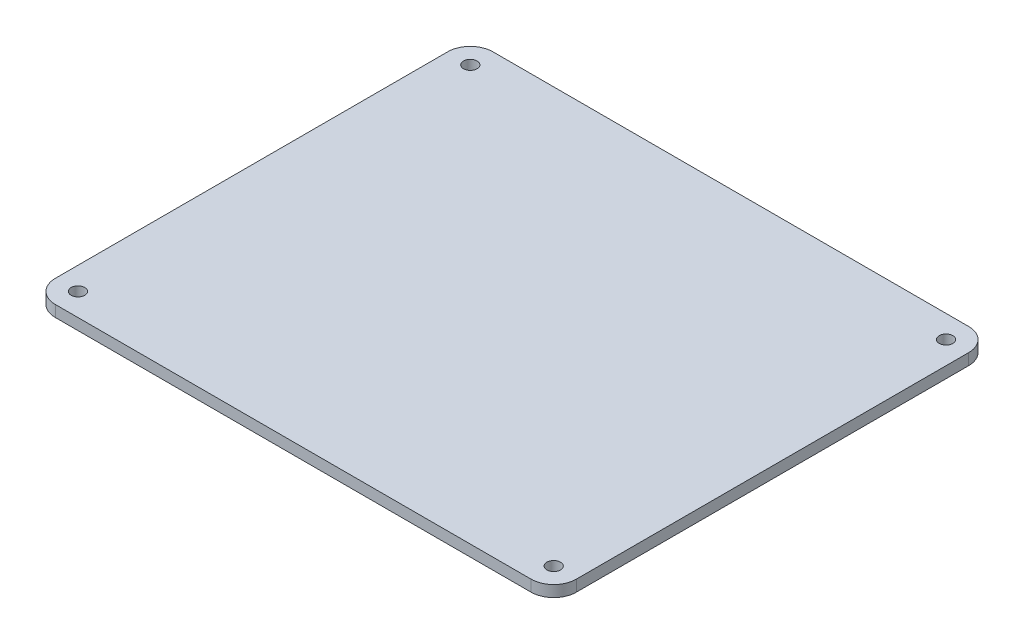
ISO-10303-21;
HEADER;
FILE_DESCRIPTION(('STEP AP214'),'2;1');
FILE_NAME('part.step','',(''),(''),'','','');
FILE_SCHEMA(('AUTOMOTIVE_DESIGN { 1 0 10303 214 1 1 1 1 }'));
ENDSEC;
DATA;
#1=APPLICATION_CONTEXT('core data for automotive mechanical design processes');
#2=APPLICATION_PROTOCOL_DEFINITION('international standard','automotive_design',2000,#1);
#3=PRODUCT_CONTEXT('',#1,'mechanical');
#4=PRODUCT('Part','Part','',(#3));
#5=PRODUCT_RELATED_PRODUCT_CATEGORY('part','',(#4));
#6=PRODUCT_DEFINITION_FORMATION('','',#4);
#7=PRODUCT_DEFINITION_CONTEXT('part definition',#1,'design');
#8=PRODUCT_DEFINITION('design','',#6,#7);
#9=PRODUCT_DEFINITION_SHAPE('','',#8);
#10=(LENGTH_UNIT() NAMED_UNIT(*) SI_UNIT(.MILLI.,.METRE.));
#11=(NAMED_UNIT(*) PLANE_ANGLE_UNIT() SI_UNIT($,.RADIAN.));
#12=(NAMED_UNIT(*) SI_UNIT($,.STERADIAN.) SOLID_ANGLE_UNIT());
#13=UNCERTAINTY_MEASURE_WITH_UNIT(LENGTH_MEASURE(1.E-05),#10,'distance_accuracy_value','');
#14=(GEOMETRIC_REPRESENTATION_CONTEXT(3) GLOBAL_UNCERTAINTY_ASSIGNED_CONTEXT((#13)) GLOBAL_UNIT_ASSIGNED_CONTEXT((#10,
#11,#12)) REPRESENTATION_CONTEXT('',''));
#15=CARTESIAN_POINT('',(0.,0.,0.));
#16=DIRECTION('',(0.,0.,1.));
#17=DIRECTION('',(1.,0.,0.));
#18=AXIS2_PLACEMENT_3D('',#15,#16,#17);
#19=CARTESIAN_POINT('',(-135.63044273454,27.1371137303564,-29.9177020021704));
#20=DIRECTION('',(0.,-1.,0.));
#21=DIRECTION('',(0.,0.,-1.));
#22=AXIS2_PLACEMENT_3D('',#19,#20,#21);
#23=PLANE('',#22);
#24=CARTESIAN_POINT('',(-135.63044273454,27.1371137303564,-29.9177020021704));
#25=DIRECTION('',(0.,1.,0.));
#26=DIRECTION('',(0.,0.,-1.));
#27=AXIS2_PLACEMENT_3D('',#24,#25,#26);
#28=CIRCLE('',#27,5.);
#29=CARTESIAN_POINT('',(-135.63044273454,27.1371137303564,-34.9177020021704));
#30=VERTEX_POINT('',#29);
#31=CARTESIAN_POINT('',(-140.63044273454,27.1371137303564,-29.9177020021704));
#32=VERTEX_POINT('',#31);
#33=EDGE_CURVE('E146',#30,#32,#28,.T.);
#34=ORIENTED_EDGE('',*,*,#33,.T.);
#35=DIRECTION('',(0.,0.,1.));
#36=VECTOR('',#35,1.);
#37=CARTESIAN_POINT('',(-140.63044273454,27.1371137303564,-29.9177020021704));
#38=LINE('',#37,#36);
#39=CARTESIAN_POINT('',(-140.63044273454,27.1371137303564,56.727321583706));
#40=VERTEX_POINT('',#39);
#41=EDGE_CURVE('E94',#32,#40,#38,.T.);
#42=ORIENTED_EDGE('',*,*,#41,.T.);
#43=CARTESIAN_POINT('',(-135.63044273454,27.1371137303564,56.7273215837061));
#44=DIRECTION('',(0.,1.,0.));
#45=DIRECTION('',(0.,0.,-1.));
#46=AXIS2_PLACEMENT_3D('',#43,#44,#45);
#47=CIRCLE('',#46,5.);
#48=CARTESIAN_POINT('',(-135.63044273454,27.1371137303564,61.7273215837061));
#49=VERTEX_POINT('',#48);
#50=EDGE_CURVE('E161',#40,#49,#47,.T.);
#51=ORIENTED_EDGE('',*,*,#50,.T.);
#52=DIRECTION('',(1.,0.,0.));
#53=VECTOR('',#52,1.);
#54=CARTESIAN_POINT('',(-135.63044273454,27.1371137303564,61.7273215837061));
#55=LINE('',#54,#53);
#56=CARTESIAN_POINT('',(-30.5685157154369,27.1371137303564,61.7273215837061));
#57=VERTEX_POINT('',#56);
#58=EDGE_CURVE('E174',#49,#57,#55,.T.);
#59=ORIENTED_EDGE('',*,*,#58,.T.);
#60=CARTESIAN_POINT('',(-30.5685157154369,27.1371137303564,56.7273215837061));
#61=DIRECTION('',(0.,1.,0.));
#62=DIRECTION('',(0.,0.,-1.));
#63=AXIS2_PLACEMENT_3D('',#60,#61,#62);
#64=CIRCLE('',#63,5.);
#65=CARTESIAN_POINT('',(-25.5685157154369,27.1371137303564,56.727321583706));
#66=VERTEX_POINT('',#65);
#67=EDGE_CURVE('E113',#57,#66,#64,.T.);
#68=ORIENTED_EDGE('',*,*,#67,.T.);
#69=DIRECTION('',(0.,0.,-1.));
#70=VECTOR('',#69,1.);
#71=CARTESIAN_POINT('',(-25.5685157154369,27.1371137303564,-29.9177020021704));
#72=LINE('',#71,#70);
#73=CARTESIAN_POINT('',(-25.5685157154369,27.1371137303564,-29.9177020021704));
#74=VERTEX_POINT('',#73);
#75=EDGE_CURVE('E107',#66,#74,#72,.T.);
#76=ORIENTED_EDGE('',*,*,#75,.T.);
#77=CARTESIAN_POINT('',(-30.5685157154369,27.1371137303564,-29.9177020021704));
#78=DIRECTION('',(0.,1.,0.));
#79=DIRECTION('',(0.,0.,1.));
#80=AXIS2_PLACEMENT_3D('',#77,#78,#79);
#81=CIRCLE('',#80,5.);
#82=CARTESIAN_POINT('',(-30.5685157154369,27.1371137303564,-34.9177020021704));
#83=VERTEX_POINT('',#82);
#84=EDGE_CURVE('E111',#74,#83,#81,.T.);
#85=ORIENTED_EDGE('',*,*,#84,.T.);
#86=DIRECTION('',(-1.,0.,0.));
#87=VECTOR('',#86,1.);
#88=CARTESIAN_POINT('',(-135.63044273454,27.1371137303564,-34.9177020021704));
#89=LINE('',#88,#87);
#90=EDGE_CURVE('E51',#83,#30,#89,.T.);
#91=ORIENTED_EDGE('',*,*,#90,.T.);
#92=EDGE_LOOP('',(#34,#42,#51,#59,#68,#76,#85,#91));
#93=FACE_BOUND('',#92,.T.);
#94=CARTESIAN_POINT('',(-135.63044273454,27.1371137303564,-29.9177020021704));
#95=DIRECTION('',(0.,1.,0.));
#96=DIRECTION('',(0.,0.,1.));
#97=AXIS2_PLACEMENT_3D('',#94,#95,#96);
#98=CIRCLE('',#97,1.5);
#99=CARTESIAN_POINT('',(-135.63044273454,27.1371137303564,-28.4177020021704));
#100=VERTEX_POINT('',#99);
#101=EDGE_CURVE('E135',#100,#100,#98,.T.);
#102=ORIENTED_EDGE('',*,*,#101,.F.);
#103=EDGE_LOOP('',(#102));
#104=FACE_BOUND('',#103,.T.);
#105=CARTESIAN_POINT('',(-30.5685157154369,27.1371137303564,-29.9177020021704));
#106=DIRECTION('',(0.,1.,0.));
#107=DIRECTION('',(0.,0.,1.));
#108=AXIS2_PLACEMENT_3D('',#105,#106,#107);
#109=CIRCLE('',#108,1.50000000000005);
#110=CARTESIAN_POINT('',(-30.5685157154369,27.1371137303564,-28.4177020021704));
#111=VERTEX_POINT('',#110);
#112=EDGE_CURVE('E183',#111,#111,#109,.T.);
#113=ORIENTED_EDGE('',*,*,#112,.F.);
#114=EDGE_LOOP('',(#113));
#115=FACE_BOUND('',#114,.T.);
#116=CARTESIAN_POINT('',(-30.5685157154369,27.1371137303564,56.7273215837061));
#117=DIRECTION('',(0.,1.,0.));
#118=DIRECTION('',(0.,0.,1.));
#119=AXIS2_PLACEMENT_3D('',#116,#117,#118);
#120=CIRCLE('',#119,1.49999999999999);
#121=CARTESIAN_POINT('',(-30.5685157154369,27.1371137303564,58.227321583706));
#122=VERTEX_POINT('',#121);
#123=EDGE_CURVE('E189',#122,#122,#120,.T.);
#124=ORIENTED_EDGE('',*,*,#123,.F.);
#125=EDGE_LOOP('',(#124));
#126=FACE_BOUND('',#125,.T.);
#127=CARTESIAN_POINT('',(-135.63044273454,27.1371137303564,56.7273215837061));
#128=DIRECTION('',(0.,1.,0.));
#129=DIRECTION('',(0.,0.,1.));
#130=AXIS2_PLACEMENT_3D('',#127,#128,#129);
#131=CIRCLE('',#130,1.5);
#132=CARTESIAN_POINT('',(-135.63044273454,27.1371137303564,58.2273215837061));
#133=VERTEX_POINT('',#132);
#134=EDGE_CURVE('E195',#133,#133,#131,.T.);
#135=ORIENTED_EDGE('',*,*,#134,.F.);
#136=EDGE_LOOP('',(#135));
#137=FACE_BOUND('',#136,.T.);
#138=ADVANCED_FACE('F34',(#93,#104,#115,#126,#137),#23,.F.);
#139=CARTESIAN_POINT('',(-135.63044273454,24.6371137303564,-29.9177020021704));
#140=DIRECTION('',(0.,-1.,0.));
#141=DIRECTION('',(0.,0.,-1.));
#142=AXIS2_PLACEMENT_3D('',#139,#140,#141);
#143=PLANE('',#142);
#144=CARTESIAN_POINT('',(-30.5685157154369,24.6371137303564,56.7273215837061));
#145=DIRECTION('',(0.,1.,0.));
#146=DIRECTION('',(0.,0.,1.));
#147=AXIS2_PLACEMENT_3D('',#144,#145,#146);
#148=CIRCLE('',#147,1.49999999999999);
#149=CARTESIAN_POINT('',(-30.5685157154369,24.6371137303564,58.227321583706));
#150=VERTEX_POINT('',#149);
#151=EDGE_CURVE('E192',#150,#150,#148,.T.);
#152=ORIENTED_EDGE('',*,*,#151,.T.);
#153=EDGE_LOOP('',(#152));
#154=FACE_BOUND('',#153,.T.);
#155=CARTESIAN_POINT('',(-135.63044273454,24.6371137303564,-29.9177020021704));
#156=DIRECTION('',(0.,1.,0.));
#157=DIRECTION('',(0.,0.,1.));
#158=AXIS2_PLACEMENT_3D('',#155,#156,#157);
#159=CIRCLE('',#158,1.5);
#160=CARTESIAN_POINT('',(-135.63044273454,24.6371137303564,-28.4177020021704));
#161=VERTEX_POINT('',#160);
#162=EDGE_CURVE('E180',#161,#161,#159,.T.);
#163=ORIENTED_EDGE('',*,*,#162,.T.);
#164=EDGE_LOOP('',(#163));
#165=FACE_BOUND('',#164,.T.);
#166=CARTESIAN_POINT('',(-135.63044273454,24.6371137303564,-29.9177020021704));
#167=DIRECTION('',(0.,1.,0.));
#168=DIRECTION('',(0.,0.,-1.));
#169=AXIS2_PLACEMENT_3D('',#166,#167,#168);
#170=CIRCLE('',#169,5.);
#171=CARTESIAN_POINT('',(-135.63044273454,24.6371137303564,-34.9177020021704));
#172=VERTEX_POINT('',#171);
#173=CARTESIAN_POINT('',(-140.63044273454,24.6371137303564,-29.9177020021704));
#174=VERTEX_POINT('',#173);
#175=EDGE_CURVE('E131',#172,#174,#170,.T.);
#176=ORIENTED_EDGE('',*,*,#175,.F.);
#177=DIRECTION('',(-1.,0.,0.));
#178=VECTOR('',#177,1.);
#179=CARTESIAN_POINT('',(-135.63044273454,24.6371137303564,-34.9177020021704));
#180=LINE('',#179,#178);
#181=CARTESIAN_POINT('',(-30.5685157154369,24.6371137303564,-34.9177020021704));
#182=VERTEX_POINT('',#181);
#183=EDGE_CURVE('E86',#182,#172,#180,.T.);
#184=ORIENTED_EDGE('',*,*,#183,.F.);
#185=CARTESIAN_POINT('',(-30.5685157154369,24.6371137303564,-29.9177020021704));
#186=DIRECTION('',(0.,1.,0.));
#187=DIRECTION('',(0.,0.,1.));
#188=AXIS2_PLACEMENT_3D('',#185,#186,#187);
#189=CIRCLE('',#188,5.);
#190=CARTESIAN_POINT('',(-25.5685157154369,24.6371137303564,-29.9177020021704));
#191=VERTEX_POINT('',#190);
#192=EDGE_CURVE('E80',#191,#182,#189,.T.);
#193=ORIENTED_EDGE('',*,*,#192,.F.);
#194=DIRECTION('',(0.,0.,-1.));
#195=VECTOR('',#194,1.);
#196=CARTESIAN_POINT('',(-25.5685157154369,24.6371137303564,-29.9177020021704));
#197=LINE('',#196,#195);
#198=CARTESIAN_POINT('',(-25.5685157154369,24.6371137303564,56.727321583706));
#199=VERTEX_POINT('',#198);
#200=EDGE_CURVE('E121',#199,#191,#197,.T.);
#201=ORIENTED_EDGE('',*,*,#200,.F.);
#202=CARTESIAN_POINT('',(-30.5685157154369,24.6371137303564,56.7273215837061));
#203=DIRECTION('',(0.,1.,0.));
#204=DIRECTION('',(0.,0.,-1.));
#205=AXIS2_PLACEMENT_3D('',#202,#203,#204);
#206=CIRCLE('',#205,5.);
#207=CARTESIAN_POINT('',(-30.5685157154369,24.6371137303564,61.7273215837061));
#208=VERTEX_POINT('',#207);
#209=EDGE_CURVE('E141',#208,#199,#206,.T.);
#210=ORIENTED_EDGE('',*,*,#209,.F.);
#211=DIRECTION('',(1.,0.,0.));
#212=VECTOR('',#211,1.);
#213=CARTESIAN_POINT('',(-135.63044273454,24.6371137303564,61.7273215837061));
#214=LINE('',#213,#212);
#215=CARTESIAN_POINT('',(-135.63044273454,24.6371137303564,61.7273215837061));
#216=VERTEX_POINT('',#215);
#217=EDGE_CURVE('E139',#216,#208,#214,.T.);
#218=ORIENTED_EDGE('',*,*,#217,.F.);
#219=CARTESIAN_POINT('',(-135.63044273454,24.6371137303564,56.7273215837061));
#220=DIRECTION('',(0.,1.,0.));
#221=DIRECTION('',(0.,0.,-1.));
#222=AXIS2_PLACEMENT_3D('',#219,#220,#221);
#223=CIRCLE('',#222,5.);
#224=CARTESIAN_POINT('',(-140.63044273454,24.6371137303564,56.727321583706));
#225=VERTEX_POINT('',#224);
#226=EDGE_CURVE('E137',#225,#216,#223,.T.);
#227=ORIENTED_EDGE('',*,*,#226,.F.);
#228=DIRECTION('',(0.,0.,1.));
#229=VECTOR('',#228,1.);
#230=CARTESIAN_POINT('',(-140.63044273454,24.6371137303564,-29.9177020021704));
#231=LINE('',#230,#229);
#232=EDGE_CURVE('E134',#174,#225,#231,.T.);
#233=ORIENTED_EDGE('',*,*,#232,.F.);
#234=EDGE_LOOP('',(#176,#184,#193,#201,#210,#218,#227,#233));
#235=FACE_BOUND('',#234,.T.);
#236=CARTESIAN_POINT('',(-30.5685157154369,24.6371137303564,-29.9177020021704));
#237=DIRECTION('',(0.,1.,0.));
#238=DIRECTION('',(0.,0.,1.));
#239=AXIS2_PLACEMENT_3D('',#236,#237,#238);
#240=CIRCLE('',#239,1.50000000000005);
#241=CARTESIAN_POINT('',(-30.5685157154369,24.6371137303564,-28.4177020021704));
#242=VERTEX_POINT('',#241);
#243=EDGE_CURVE('E186',#242,#242,#240,.T.);
#244=ORIENTED_EDGE('',*,*,#243,.T.);
#245=EDGE_LOOP('',(#244));
#246=FACE_BOUND('',#245,.T.);
#247=CARTESIAN_POINT('',(-135.63044273454,24.6371137303564,56.7273215837061));
#248=DIRECTION('',(0.,1.,0.));
#249=DIRECTION('',(0.,0.,1.));
#250=AXIS2_PLACEMENT_3D('',#247,#248,#249);
#251=CIRCLE('',#250,1.5);
#252=CARTESIAN_POINT('',(-135.63044273454,24.6371137303564,58.2273215837061));
#253=VERTEX_POINT('',#252);
#254=EDGE_CURVE('E198',#253,#253,#251,.T.);
#255=ORIENTED_EDGE('',*,*,#254,.T.);
#256=EDGE_LOOP('',(#255));
#257=FACE_BOUND('',#256,.T.);
#258=ADVANCED_FACE('F165',(#154,#165,#235,#246,#257),#143,.T.);
#259=CARTESIAN_POINT('',(-135.63044273454,27.1371137303564,-29.9177020021704));
#260=DIRECTION('',(0.,-1.,0.));
#261=DIRECTION('',(0.,0.,-1.));
#262=AXIS2_PLACEMENT_3D('',#259,#260,#261);
#263=CYLINDRICAL_SURFACE('',#262,5.);
#264=ORIENTED_EDGE('',*,*,#175,.T.);
#265=DIRECTION('',(0.,-1.,0.));
#266=VECTOR('',#265,1.);
#267=CARTESIAN_POINT('',(-140.63044273454,27.1371137303564,-29.9177020021704));
#268=LINE('',#267,#266);
#269=EDGE_CURVE('E11',#32,#174,#268,.T.);
#270=ORIENTED_EDGE('',*,*,#269,.F.);
#271=ORIENTED_EDGE('',*,*,#33,.F.);
#272=DIRECTION('',(0.,-1.,0.));
#273=VECTOR('',#272,1.);
#274=CARTESIAN_POINT('',(-135.63044273454,27.1371137303564,-34.9177020021704));
#275=LINE('',#274,#273);
#276=EDGE_CURVE('E127',#30,#172,#275,.T.);
#277=ORIENTED_EDGE('',*,*,#276,.T.);
#278=EDGE_LOOP('',(#264,#270,#271,#277));
#279=FACE_BOUND('',#278,.T.);
#280=ADVANCED_FACE('F36',(#279),#263,.T.);
#281=CARTESIAN_POINT('',(-140.63044273454,27.1371137303564,-29.9177020021704));
#282=DIRECTION('',(1.,0.,0.));
#283=DIRECTION('',(0.,0.,-1.));
#284=AXIS2_PLACEMENT_3D('',#281,#282,#283);
#285=PLANE('',#284);
#286=ORIENTED_EDGE('',*,*,#232,.T.);
#287=DIRECTION('',(0.,-1.,0.));
#288=VECTOR('',#287,1.);
#289=CARTESIAN_POINT('',(-140.63044273454,27.1371137303564,56.727321583706));
#290=LINE('',#289,#288);
#291=EDGE_CURVE('E43',#40,#225,#290,.T.);
#292=ORIENTED_EDGE('',*,*,#291,.F.);
#293=ORIENTED_EDGE('',*,*,#41,.F.);
#294=ORIENTED_EDGE('',*,*,#269,.T.);
#295=EDGE_LOOP('',(#286,#292,#293,#294));
#296=FACE_BOUND('',#295,.T.);
#297=ADVANCED_FACE('F230',(#296),#285,.F.);
#298=CARTESIAN_POINT('',(-135.63044273454,27.1371137303564,56.7273215837061));
#299=DIRECTION('',(0.,-1.,0.));
#300=DIRECTION('',(0.,0.,-1.));
#301=AXIS2_PLACEMENT_3D('',#298,#299,#300);
#302=CYLINDRICAL_SURFACE('',#301,5.);
#303=ORIENTED_EDGE('',*,*,#226,.T.);
#304=DIRECTION('',(0.,-1.,0.));
#305=VECTOR('',#304,1.);
#306=CARTESIAN_POINT('',(-135.63044273454,27.1371137303564,61.7273215837061));
#307=LINE('',#306,#305);
#308=EDGE_CURVE('E153',#49,#216,#307,.T.);
#309=ORIENTED_EDGE('',*,*,#308,.F.);
#310=ORIENTED_EDGE('',*,*,#50,.F.);
#311=ORIENTED_EDGE('',*,*,#291,.T.);
#312=EDGE_LOOP('',(#303,#309,#310,#311));
#313=FACE_BOUND('',#312,.T.);
#314=ADVANCED_FACE('F159',(#313),#302,.T.);
#315=CARTESIAN_POINT('',(-135.63044273454,27.1371137303564,61.7273215837061));
#316=DIRECTION('',(0.,0.,-1.));
#317=DIRECTION('',(-1.,0.,0.));
#318=AXIS2_PLACEMENT_3D('',#315,#316,#317);
#319=PLANE('',#318);
#320=ORIENTED_EDGE('',*,*,#217,.T.);
#321=DIRECTION('',(0.,-1.,0.));
#322=VECTOR('',#321,1.);
#323=CARTESIAN_POINT('',(-30.5685157154369,27.1371137303564,61.7273215837061));
#324=LINE('',#323,#322);
#325=EDGE_CURVE('E150',#57,#208,#324,.T.);
#326=ORIENTED_EDGE('',*,*,#325,.F.);
#327=ORIENTED_EDGE('',*,*,#58,.F.);
#328=ORIENTED_EDGE('',*,*,#308,.T.);
#329=EDGE_LOOP('',(#320,#326,#327,#328));
#330=FACE_BOUND('',#329,.T.);
#331=ADVANCED_FACE('F170',(#330),#319,.F.);
#332=CARTESIAN_POINT('',(-30.5685157154369,27.1371137303564,56.7273215837061));
#333=DIRECTION('',(0.,-1.,0.));
#334=DIRECTION('',(0.,0.,-1.));
#335=AXIS2_PLACEMENT_3D('',#332,#333,#334);
#336=CYLINDRICAL_SURFACE('',#335,5.);
#337=ORIENTED_EDGE('',*,*,#209,.T.);
#338=DIRECTION('',(0.,-1.,0.));
#339=VECTOR('',#338,1.);
#340=CARTESIAN_POINT('',(-25.5685157154369,27.1371137303564,56.727321583706));
#341=LINE('',#340,#339);
#342=EDGE_CURVE('E122',#66,#199,#341,.T.);
#343=ORIENTED_EDGE('',*,*,#342,.F.);
#344=ORIENTED_EDGE('',*,*,#67,.F.);
#345=ORIENTED_EDGE('',*,*,#325,.T.);
#346=EDGE_LOOP('',(#337,#343,#344,#345));
#347=FACE_BOUND('',#346,.T.);
#348=ADVANCED_FACE('F173',(#347),#336,.T.);
#349=CARTESIAN_POINT('',(-25.5685157154369,27.1371137303564,-29.9177020021704));
#350=DIRECTION('',(-1.,0.,0.));
#351=DIRECTION('',(0.,0.,1.));
#352=AXIS2_PLACEMENT_3D('',#349,#350,#351);
#353=PLANE('',#352);
#354=ORIENTED_EDGE('',*,*,#200,.T.);
#355=DIRECTION('',(0.,-1.,0.));
#356=VECTOR('',#355,1.);
#357=CARTESIAN_POINT('',(-25.5685157154369,27.1371137303564,-29.9177020021704));
#358=LINE('',#357,#356);
#359=EDGE_CURVE('E118',#74,#191,#358,.T.);
#360=ORIENTED_EDGE('',*,*,#359,.F.);
#361=ORIENTED_EDGE('',*,*,#75,.F.);
#362=ORIENTED_EDGE('',*,*,#342,.T.);
#363=EDGE_LOOP('',(#354,#360,#361,#362));
#364=FACE_BOUND('',#363,.T.);
#365=ADVANCED_FACE('F119',(#364),#353,.F.);
#366=CARTESIAN_POINT('',(-30.5685157154369,27.1371137303564,-29.9177020021704));
#367=DIRECTION('',(0.,-1.,0.));
#368=DIRECTION('',(0.,0.,-1.));
#369=AXIS2_PLACEMENT_3D('',#366,#367,#368);
#370=CYLINDRICAL_SURFACE('',#369,5.);
#371=ORIENTED_EDGE('',*,*,#192,.T.);
#372=DIRECTION('',(0.,-1.,0.));
#373=VECTOR('',#372,1.);
#374=CARTESIAN_POINT('',(-30.5685157154369,27.1371137303564,-34.9177020021704));
#375=LINE('',#374,#373);
#376=EDGE_CURVE('E123',#83,#182,#375,.T.);
#377=ORIENTED_EDGE('',*,*,#376,.F.);
#378=ORIENTED_EDGE('',*,*,#84,.F.);
#379=ORIENTED_EDGE('',*,*,#359,.T.);
#380=EDGE_LOOP('',(#371,#377,#378,#379));
#381=FACE_BOUND('',#380,.T.);
#382=ADVANCED_FACE('F125',(#381),#370,.T.);
#383=CARTESIAN_POINT('',(-135.63044273454,27.1371137303564,-34.9177020021704));
#384=DIRECTION('',(0.,0.,1.));
#385=DIRECTION('',(1.,0.,0.));
#386=AXIS2_PLACEMENT_3D('',#383,#384,#385);
#387=PLANE('',#386);
#388=ORIENTED_EDGE('',*,*,#183,.T.);
#389=ORIENTED_EDGE('',*,*,#276,.F.);
#390=ORIENTED_EDGE('',*,*,#90,.F.);
#391=ORIENTED_EDGE('',*,*,#376,.T.);
#392=EDGE_LOOP('',(#388,#389,#390,#391));
#393=FACE_BOUND('',#392,.T.);
#394=ADVANCED_FACE('F218',(#393),#387,.F.);
#395=CARTESIAN_POINT('',(-135.63044273454,27.1371137303564,-29.9177020021704));
#396=DIRECTION('',(0.,-1.,0.));
#397=DIRECTION('',(0.,0.,-1.));
#398=AXIS2_PLACEMENT_3D('',#395,#396,#397);
#399=CYLINDRICAL_SURFACE('',#398,1.5);
#400=ORIENTED_EDGE('',*,*,#101,.T.);
#401=EDGE_LOOP('',(#400));
#402=FACE_BOUND('',#401,.T.);
#403=ORIENTED_EDGE('',*,*,#162,.F.);
#404=EDGE_LOOP('',(#403));
#405=FACE_BOUND('',#404,.T.);
#406=ADVANCED_FACE('F215',(#402,#405),#399,.F.);
#407=CARTESIAN_POINT('',(-30.5685157154369,27.1371137303564,-29.9177020021704));
#408=DIRECTION('',(0.,-1.,0.));
#409=DIRECTION('',(0.,0.,-1.));
#410=AXIS2_PLACEMENT_3D('',#407,#408,#409);
#411=CYLINDRICAL_SURFACE('',#410,1.50000000000005);
#412=ORIENTED_EDGE('',*,*,#112,.T.);
#413=EDGE_LOOP('',(#412));
#414=FACE_BOUND('',#413,.T.);
#415=ORIENTED_EDGE('',*,*,#243,.F.);
#416=EDGE_LOOP('',(#415));
#417=FACE_BOUND('',#416,.T.);
#418=ADVANCED_FACE('F294',(#414,#417),#411,.F.);
#419=CARTESIAN_POINT('',(-30.5685157154369,27.1371137303564,56.7273215837061));
#420=DIRECTION('',(0.,-1.,0.));
#421=DIRECTION('',(0.,0.,-1.));
#422=AXIS2_PLACEMENT_3D('',#419,#420,#421);
#423=CYLINDRICAL_SURFACE('',#422,1.49999999999999);
#424=ORIENTED_EDGE('',*,*,#123,.T.);
#425=EDGE_LOOP('',(#424));
#426=FACE_BOUND('',#425,.T.);
#427=ORIENTED_EDGE('',*,*,#151,.F.);
#428=EDGE_LOOP('',(#427));
#429=FACE_BOUND('',#428,.T.);
#430=ADVANCED_FACE('F302',(#426,#429),#423,.F.);
#431=CARTESIAN_POINT('',(-135.63044273454,27.1371137303564,56.7273215837061));
#432=DIRECTION('',(0.,-1.,0.));
#433=DIRECTION('',(0.,0.,-1.));
#434=AXIS2_PLACEMENT_3D('',#431,#432,#433);
#435=CYLINDRICAL_SURFACE('',#434,1.5);
#436=ORIENTED_EDGE('',*,*,#134,.T.);
#437=EDGE_LOOP('',(#436));
#438=FACE_BOUND('',#437,.T.);
#439=ORIENTED_EDGE('',*,*,#254,.F.);
#440=EDGE_LOOP('',(#439));
#441=FACE_BOUND('',#440,.T.);
#442=ADVANCED_FACE('F204',(#438,#441),#435,.F.);
#443=CLOSED_SHELL('',(#138,#258,#280,#297,#314,#331,#348,#365,#382,#394,#406,#418,#430,#442));
#444=MANIFOLD_SOLID_BREP('B2',#443);
#445=ADVANCED_BREP_SHAPE_REPRESENTATION('',(#18,#444),#14);
#446=SHAPE_DEFINITION_REPRESENTATION(#9,#445);
ENDSEC;
END-ISO-10303-21;
